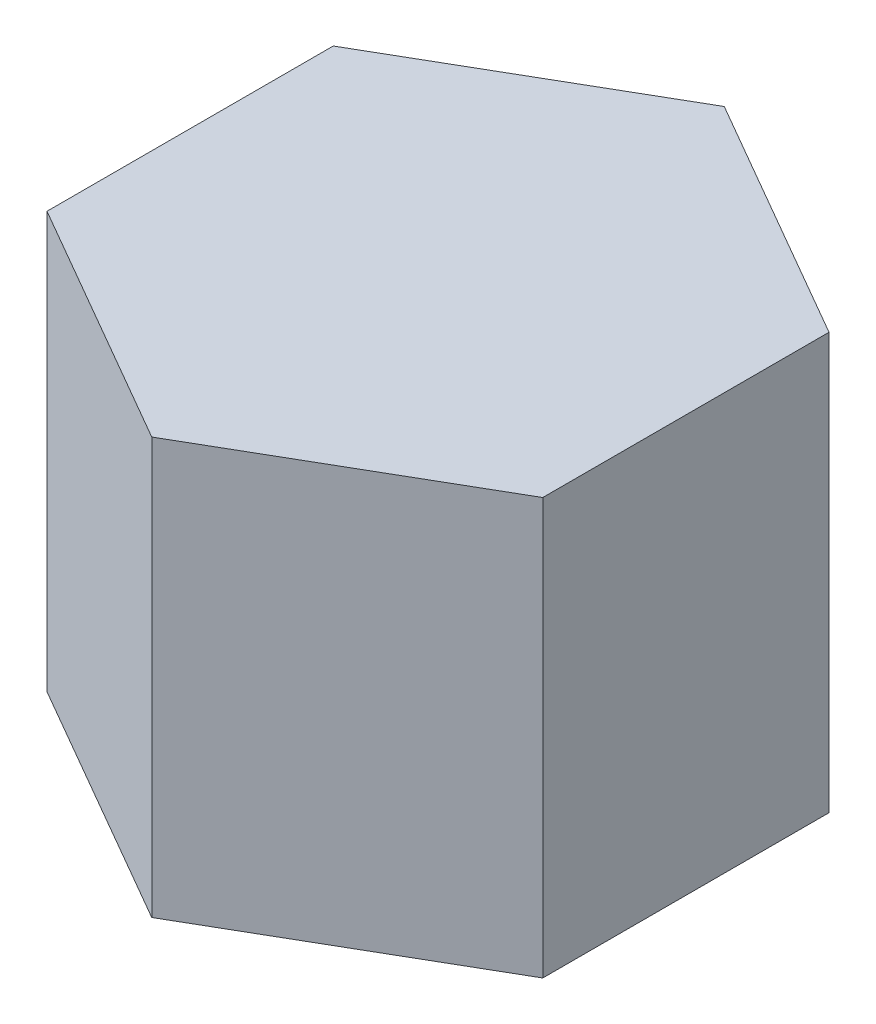
ISO-10303-21;
HEADER;
FILE_DESCRIPTION(('STEP AP214'),'2;1');
FILE_NAME('part.step','',(''),(''),'','','');
FILE_SCHEMA(('AUTOMOTIVE_DESIGN { 1 0 10303 214 1 1 1 1 }'));
ENDSEC;
DATA;
#1=APPLICATION_CONTEXT('core data for automotive mechanical design processes');
#2=APPLICATION_PROTOCOL_DEFINITION('international standard','automotive_design',2000,#1);
#3=PRODUCT_CONTEXT('',#1,'mechanical');
#4=PRODUCT('Part','Part','',(#3));
#5=PRODUCT_RELATED_PRODUCT_CATEGORY('part','',(#4));
#6=PRODUCT_DEFINITION_FORMATION('','',#4);
#7=PRODUCT_DEFINITION_CONTEXT('part definition',#1,'design');
#8=PRODUCT_DEFINITION('design','',#6,#7);
#9=PRODUCT_DEFINITION_SHAPE('','',#8);
#10=(LENGTH_UNIT() NAMED_UNIT(*) SI_UNIT(.MILLI.,.METRE.));
#11=(NAMED_UNIT(*) PLANE_ANGLE_UNIT() SI_UNIT($,.RADIAN.));
#12=(NAMED_UNIT(*) SI_UNIT($,.STERADIAN.) SOLID_ANGLE_UNIT());
#13=UNCERTAINTY_MEASURE_WITH_UNIT(LENGTH_MEASURE(1.E-05),#10,'distance_accuracy_value','');
#14=(GEOMETRIC_REPRESENTATION_CONTEXT(3) GLOBAL_UNCERTAINTY_ASSIGNED_CONTEXT((#13)) GLOBAL_UNIT_ASSIGNED_CONTEXT((#10,
#11,#12)) REPRESENTATION_CONTEXT('',''));
#15=CARTESIAN_POINT('',(0.,0.,0.));
#16=DIRECTION('',(0.,0.,1.));
#17=DIRECTION('',(1.,0.,0.));
#18=AXIS2_PLACEMENT_3D('',#15,#16,#17);
#19=CARTESIAN_POINT('',(206.339551417382,-147.556598747966,291.681971220494));
#20=DIRECTION('',(-0.500000000000131,0.,-0.866025403784363));
#21=DIRECTION('',(-0.866025403784363,0.,0.500000000000131));
#22=AXIS2_PLACEMENT_3D('',#19,#20,#21);
#23=PLANE('',#22);
#24=CARTESIAN_POINT('',(206.642660308706,-147.047793579175,291.506971220494));
#25=DIRECTION('',(-0.866025403784363,0.,0.500000000000131));
#26=VECTOR('',#25,1.);
#27=LINE('',#24,#26);
#28=CARTESIAN_POINT('',(206.642660308706,-147.047793579175,291.506971220494));
#29=VERTEX_POINT('',#28);
#30=CARTESIAN_POINT('',(206.339551417382,-147.047793579175,291.681971220494));
#31=VERTEX_POINT('',#30);
#32=EDGE_CURVE('E170',#29,#31,#27,.T.);
#33=ORIENTED_EDGE('',*,*,#32,.T.);
#34=CARTESIAN_POINT('',(206.339551417382,-147.556598747966,291.681971220494));
#35=DIRECTION('',(0.,1.,0.));
#36=VECTOR('',#35,1.);
#37=LINE('',#34,#36);
#38=CARTESIAN_POINT('',(206.339551417382,-147.556598747966,291.681971220494));
#39=VERTEX_POINT('',#38);
#40=EDGE_CURVE('E35',#39,#31,#37,.T.);
#41=ORIENTED_EDGE('',*,*,#40,.F.);
#42=CARTESIAN_POINT('',(206.642660308706,-147.556598747966,291.506971220494));
#43=DIRECTION('',(-0.866025403784363,0.,0.500000000000131));
#44=VECTOR('',#43,1.);
#45=LINE('',#42,#44);
#46=CARTESIAN_POINT('',(206.642660308706,-147.556598747966,291.506971220494));
#47=VERTEX_POINT('',#46);
#48=EDGE_CURVE('E159',#47,#39,#45,.T.);
#49=ORIENTED_EDGE('',*,*,#48,.F.);
#50=CARTESIAN_POINT('',(206.642660308706,-147.556598747966,291.506971220494));
#51=DIRECTION('',(0.,1.,0.));
#52=VECTOR('',#51,1.);
#53=LINE('',#50,#52);
#54=EDGE_CURVE('E10',#47,#29,#53,.T.);
#55=ORIENTED_EDGE('',*,*,#54,.T.);
#56=EDGE_LOOP('',(#33,#41,#49,#55));
#57=FACE_BOUND('',#56,.T.);
#58=ADVANCED_FACE('F16',(#57),#23,.F.);
#59=CARTESIAN_POINT('',(206.642660308706,-147.556598747966,291.594471220494));
#60=DIRECTION('',(-1.,0.,0.));
#61=DIRECTION('',(0.,-1.,0.));
#62=AXIS2_PLACEMENT_3D('',#59,#60,#61);
#63=PLANE('',#62);
#64=CARTESIAN_POINT('',(206.642660308706,-147.047793579175,291.156971220494));
#65=DIRECTION('',(0.,0.,1.));
#66=VECTOR('',#65,1.);
#67=LINE('',#64,#66);
#68=CARTESIAN_POINT('',(206.642660308706,-147.047793579175,291.156971220494));
#69=VERTEX_POINT('',#68);
#70=EDGE_CURVE('E167',#69,#29,#67,.T.);
#71=ORIENTED_EDGE('',*,*,#70,.T.);
#72=ORIENTED_EDGE('',*,*,#54,.F.);
#73=CARTESIAN_POINT('',(206.642660308706,-147.556598747966,291.156971220494));
#74=DIRECTION('',(0.,0.,1.));
#75=VECTOR('',#74,1.);
#76=LINE('',#73,#75);
#77=CARTESIAN_POINT('',(206.642660308706,-147.556598747966,291.156971220494));
#78=VERTEX_POINT('',#77);
#79=EDGE_CURVE('E156',#78,#47,#76,.T.);
#80=ORIENTED_EDGE('',*,*,#79,.F.);
#81=CARTESIAN_POINT('',(206.642660308706,-147.556598747966,291.156971220494));
#82=DIRECTION('',(0.,1.,0.));
#83=VECTOR('',#82,1.);
#84=LINE('',#81,#83);
#85=EDGE_CURVE('E27',#78,#69,#84,.T.);
#86=ORIENTED_EDGE('',*,*,#85,.T.);
#87=EDGE_LOOP('',(#71,#72,#80,#86));
#88=FACE_BOUND('',#87,.T.);
#89=ADVANCED_FACE('F189',(#88),#63,.F.);
#90=CARTESIAN_POINT('',(206.642660308706,-147.556598747966,291.156971220494));
#91=DIRECTION('',(-0.499999999999943,0.,0.866025403784471));
#92=DIRECTION('',(0.866025403784471,0.,0.499999999999943));
#93=AXIS2_PLACEMENT_3D('',#90,#91,#92);
#94=PLANE('',#93);
#95=CARTESIAN_POINT('',(206.339551417382,-147.047793579175,290.981971220494));
#96=DIRECTION('',(0.866025403784471,0.,0.499999999999943));
#97=VECTOR('',#96,1.);
#98=LINE('',#95,#97);
#99=CARTESIAN_POINT('',(206.339551417382,-147.047793579175,290.981971220494));
#100=VERTEX_POINT('',#99);
#101=EDGE_CURVE('E163',#100,#69,#98,.T.);
#102=ORIENTED_EDGE('',*,*,#101,.T.);
#103=ORIENTED_EDGE('',*,*,#85,.F.);
#104=CARTESIAN_POINT('',(206.339551417382,-147.556598747966,290.981971220494));
#105=DIRECTION('',(0.866025403784471,0.,0.499999999999943));
#106=VECTOR('',#105,1.);
#107=LINE('',#104,#106);
#108=CARTESIAN_POINT('',(206.339551417382,-147.556598747966,290.981971220494));
#109=VERTEX_POINT('',#108);
#110=EDGE_CURVE('E106',#109,#78,#107,.T.);
#111=ORIENTED_EDGE('',*,*,#110,.F.);
#112=CARTESIAN_POINT('',(206.339551417382,-147.556598747966,290.981971220494));
#113=DIRECTION('',(0.,1.,0.));
#114=VECTOR('',#113,1.);
#115=LINE('',#112,#114);
#116=EDGE_CURVE('E94',#109,#100,#115,.T.);
#117=ORIENTED_EDGE('',*,*,#116,.T.);
#118=EDGE_LOOP('',(#102,#103,#111,#117));
#119=FACE_BOUND('',#118,.T.);
#120=ADVANCED_FACE('F198',(#119),#94,.F.);
#121=CARTESIAN_POINT('',(206.339551417382,-147.556598747966,290.981971220494));
#122=DIRECTION('',(0.499999999999978,0.,0.866025403784452));
#123=DIRECTION('',(0.866025403784452,0.,-0.499999999999978));
#124=AXIS2_PLACEMENT_3D('',#121,#122,#123);
#125=PLANE('',#124);
#126=CARTESIAN_POINT('',(206.036442526057,-147.047793579175,291.156971220494));
#127=DIRECTION('',(0.866025403784452,0.,-0.499999999999978));
#128=VECTOR('',#127,1.);
#129=LINE('',#126,#128);
#130=CARTESIAN_POINT('',(206.036442526057,-147.047793579175,291.156971220494));
#131=VERTEX_POINT('',#130);
#132=EDGE_CURVE('E162',#131,#100,#129,.T.);
#133=ORIENTED_EDGE('',*,*,#132,.T.);
#134=ORIENTED_EDGE('',*,*,#116,.F.);
#135=CARTESIAN_POINT('',(206.036442526057,-147.556598747966,291.156971220494));
#136=DIRECTION('',(0.866025403784452,0.,-0.499999999999978));
#137=VECTOR('',#136,1.);
#138=LINE('',#135,#137);
#139=CARTESIAN_POINT('',(206.036442526057,-147.556598747966,291.156971220494));
#140=VERTEX_POINT('',#139);
#141=EDGE_CURVE('E98',#140,#109,#138,.T.);
#142=ORIENTED_EDGE('',*,*,#141,.F.);
#143=CARTESIAN_POINT('',(206.036442526057,-147.556598747966,291.156971220494));
#144=DIRECTION('',(0.,1.,0.));
#145=VECTOR('',#144,1.);
#146=LINE('',#143,#145);
#147=EDGE_CURVE('E79',#140,#131,#146,.T.);
#148=ORIENTED_EDGE('',*,*,#147,.T.);
#149=EDGE_LOOP('',(#133,#134,#142,#148));
#150=FACE_BOUND('',#149,.T.);
#151=ADVANCED_FACE('F100',(#150),#125,.F.);
#152=CARTESIAN_POINT('',(206.036442526057,-147.556598747966,291.594471220494));
#153=DIRECTION('',(1.,0.,0.));
#154=DIRECTION('',(0.,1.,0.));
#155=AXIS2_PLACEMENT_3D('',#152,#153,#154);
#156=PLANE('',#155);
#157=CARTESIAN_POINT('',(206.036442526057,-147.047793579175,291.506971220494));
#158=DIRECTION('',(0.,0.,-1.));
#159=VECTOR('',#158,1.);
#160=LINE('',#157,#159);
#161=CARTESIAN_POINT('',(206.036442526057,-147.047793579175,291.506971220494));
#162=VERTEX_POINT('',#161);
#163=EDGE_CURVE('E88',#162,#131,#160,.T.);
#164=ORIENTED_EDGE('',*,*,#163,.T.);
#165=ORIENTED_EDGE('',*,*,#147,.F.);
#166=CARTESIAN_POINT('',(206.036442526057,-147.556598747966,291.506971220494));
#167=DIRECTION('',(0.,0.,-1.));
#168=VECTOR('',#167,1.);
#169=LINE('',#166,#168);
#170=CARTESIAN_POINT('',(206.036442526057,-147.556598747966,291.506971220494));
#171=VERTEX_POINT('',#170);
#172=EDGE_CURVE('E84',#171,#140,#169,.T.);
#173=ORIENTED_EDGE('',*,*,#172,.F.);
#174=CARTESIAN_POINT('',(206.036442526057,-147.556598747966,291.506971220494));
#175=DIRECTION('',(0.,1.,0.));
#176=VECTOR('',#175,1.);
#177=LINE('',#174,#176);
#178=EDGE_CURVE('E58',#171,#162,#177,.T.);
#179=ORIENTED_EDGE('',*,*,#178,.T.);
#180=EDGE_LOOP('',(#164,#165,#173,#179));
#181=FACE_BOUND('',#180,.T.);
#182=ADVANCED_FACE('F82',(#181),#156,.F.);
#183=CARTESIAN_POINT('',(206.036442526057,-147.556598747966,291.506971220494));
#184=DIRECTION('',(0.499999999999943,0.,-0.866025403784471));
#185=DIRECTION('',(-0.866025403784471,0.,-0.499999999999943));
#186=AXIS2_PLACEMENT_3D('',#183,#184,#185);
#187=PLANE('',#186);
#188=CARTESIAN_POINT('',(206.339551417382,-147.047793579175,291.681971220494));
#189=DIRECTION('',(-0.866025403784471,0.,-0.499999999999943));
#190=VECTOR('',#189,1.);
#191=LINE('',#188,#190);
#192=EDGE_CURVE('E160',#31,#162,#191,.T.);
#193=ORIENTED_EDGE('',*,*,#192,.T.);
#194=ORIENTED_EDGE('',*,*,#178,.F.);
#195=CARTESIAN_POINT('',(206.339551417382,-147.556598747966,291.681971220494));
#196=DIRECTION('',(-0.866025403784471,0.,-0.499999999999943));
#197=VECTOR('',#196,1.);
#198=LINE('',#195,#197);
#199=EDGE_CURVE('E112',#39,#171,#198,.T.);
#200=ORIENTED_EDGE('',*,*,#199,.F.);
#201=ORIENTED_EDGE('',*,*,#40,.T.);
#202=EDGE_LOOP('',(#193,#194,#200,#201));
#203=FACE_BOUND('',#202,.T.);
#204=ADVANCED_FACE('F131',(#203),#187,.F.);
#205=CARTESIAN_POINT('',(206.491105863044,-147.556598747966,291.594471220494));
#206=DIRECTION('',(0.,1.,0.));
#207=DIRECTION('',(-1.,0.,0.));
#208=AXIS2_PLACEMENT_3D('',#205,#206,#207);
#209=PLANE('',#208);
#210=ORIENTED_EDGE('',*,*,#48,.T.);
#211=ORIENTED_EDGE('',*,*,#199,.T.);
#212=ORIENTED_EDGE('',*,*,#172,.T.);
#213=ORIENTED_EDGE('',*,*,#141,.T.);
#214=ORIENTED_EDGE('',*,*,#110,.T.);
#215=ORIENTED_EDGE('',*,*,#79,.T.);
#216=EDGE_LOOP('',(#210,#211,#212,#213,#214,#215));
#217=FACE_BOUND('',#216,.T.);
#218=ADVANCED_FACE('F111',(#217),#209,.F.);
#219=CARTESIAN_POINT('',(206.491105863044,-147.047793579175,291.594471220494));
#220=DIRECTION('',(0.,1.,0.));
#221=DIRECTION('',(-1.,0.,0.));
#222=AXIS2_PLACEMENT_3D('',#219,#220,#221);
#223=PLANE('',#222);
#224=ORIENTED_EDGE('',*,*,#32,.F.);
#225=ORIENTED_EDGE('',*,*,#70,.F.);
#226=ORIENTED_EDGE('',*,*,#101,.F.);
#227=ORIENTED_EDGE('',*,*,#132,.F.);
#228=ORIENTED_EDGE('',*,*,#163,.F.);
#229=ORIENTED_EDGE('',*,*,#192,.F.);
#230=EDGE_LOOP('',(#224,#225,#226,#227,#228,#229));
#231=FACE_BOUND('',#230,.T.);
#232=ADVANCED_FACE('F130',(#231),#223,.T.);
#233=CLOSED_SHELL('',(#58,#89,#120,#151,#182,#204,#218,#232));
#234=MANIFOLD_SOLID_BREP('B1',#233);
#235=ADVANCED_BREP_SHAPE_REPRESENTATION('',(#18,#234),#14);
#236=SHAPE_DEFINITION_REPRESENTATION(#9,#235);
ENDSEC;
END-ISO-10303-21;
